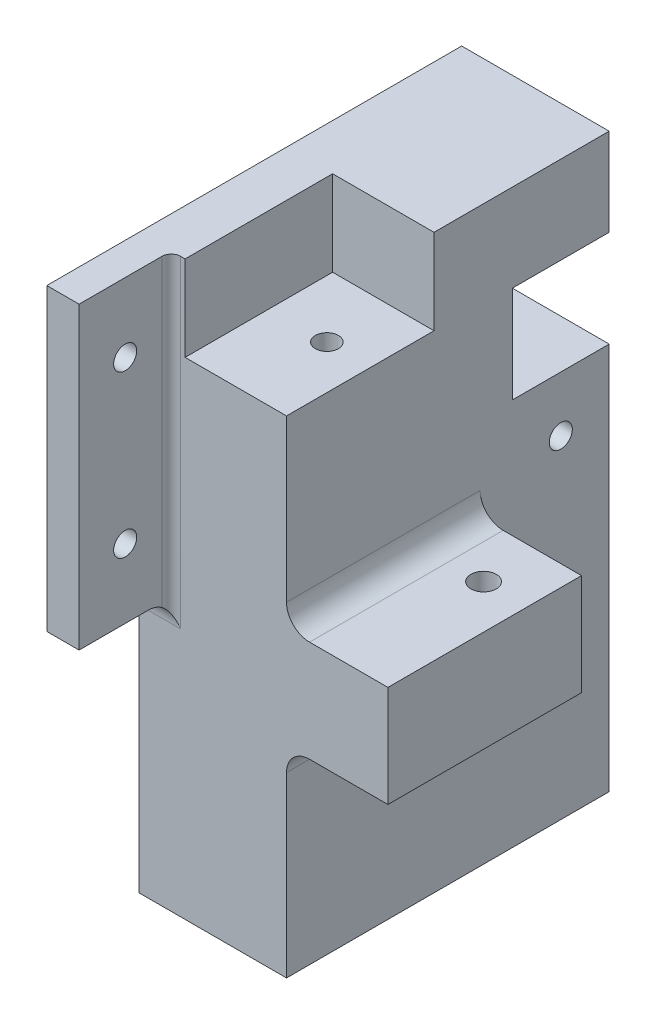
ISO-10303-21;
HEADER;
FILE_DESCRIPTION(('STEP AP214'),'2;1');
FILE_NAME('part.step','',(''),(''),'','','');
FILE_SCHEMA(('AUTOMOTIVE_DESIGN { 1 0 10303 214 1 1 1 1 }'));
ENDSEC;
DATA;
#1=APPLICATION_CONTEXT('core data for automotive mechanical design processes');
#2=APPLICATION_PROTOCOL_DEFINITION('international standard','automotive_design',2000,#1);
#3=PRODUCT_CONTEXT('',#1,'mechanical');
#4=PRODUCT('Part','Part','',(#3));
#5=PRODUCT_RELATED_PRODUCT_CATEGORY('part','',(#4));
#6=PRODUCT_DEFINITION_FORMATION('','',#4);
#7=PRODUCT_DEFINITION_CONTEXT('part definition',#1,'design');
#8=PRODUCT_DEFINITION('design','',#6,#7);
#9=PRODUCT_DEFINITION_SHAPE('','',#8);
#10=(LENGTH_UNIT() NAMED_UNIT(*) SI_UNIT(.MILLI.,.METRE.));
#11=(NAMED_UNIT(*) PLANE_ANGLE_UNIT() SI_UNIT($,.RADIAN.));
#12=(NAMED_UNIT(*) SI_UNIT($,.STERADIAN.) SOLID_ANGLE_UNIT());
#13=UNCERTAINTY_MEASURE_WITH_UNIT(LENGTH_MEASURE(1.E-05),#10,'distance_accuracy_value','');
#14=(GEOMETRIC_REPRESENTATION_CONTEXT(3) GLOBAL_UNCERTAINTY_ASSIGNED_CONTEXT((#13)) GLOBAL_UNIT_ASSIGNED_CONTEXT((#10,
#11,#12)) REPRESENTATION_CONTEXT('',''));
#15=CARTESIAN_POINT('',(0.,0.,0.));
#16=DIRECTION('',(0.,0.,1.));
#17=DIRECTION('',(1.,0.,0.));
#18=AXIS2_PLACEMENT_3D('',#15,#16,#17);
#19=CARTESIAN_POINT('',(-16.,40.,35.));
#20=DIRECTION('',(0.,0.,-1.));
#21=DIRECTION('',(-1.,0.,0.));
#22=AXIS2_PLACEMENT_3D('',#19,#20,#21);
#23=PLANE('',#22);
#24=DIRECTION('',(0.,1.,0.));
#25=VECTOR('',#24,1.);
#26=CARTESIAN_POINT('',(-6.99999999999999,-25.,35.));
#27=LINE('',#26,#25);
#28=CARTESIAN_POINT('',(-7.,40.,35.));
#29=VERTEX_POINT('',#28);
#30=CARTESIAN_POINT('',(-6.99999999999999,-30.,35.));
#31=VERTEX_POINT('',#30);
#32=EDGE_CURVE('E58',#29,#31,#27,.F.);
#33=ORIENTED_EDGE('',*,*,#32,.T.);
#34=DIRECTION('',(1.,0.,0.));
#35=VECTOR('',#34,1.);
#36=CARTESIAN_POINT('',(-16.,-30.,35.));
#37=LINE('',#36,#35);
#38=CARTESIAN_POINT('',(-16.,-30.,35.));
#39=VERTEX_POINT('',#38);
#40=EDGE_CURVE('E345',#31,#39,#37,.F.);
#41=ORIENTED_EDGE('',*,*,#40,.T.);
#42=DIRECTION('',(0.,-1.,0.));
#43=VECTOR('',#42,1.);
#44=CARTESIAN_POINT('',(-16.,40.,35.));
#45=LINE('',#44,#43);
#46=CARTESIAN_POINT('',(-16.,-84.1,35.));
#47=VERTEX_POINT('',#46);
#48=EDGE_CURVE('E319',#39,#47,#45,.T.);
#49=ORIENTED_EDGE('',*,*,#48,.T.);
#50=DIRECTION('',(1.,0.,0.));
#51=VECTOR('',#50,1.);
#52=CARTESIAN_POINT('',(-16.,-84.1,35.));
#53=LINE('',#52,#51);
#54=CARTESIAN_POINT('',(16.,-84.1,35.));
#55=VERTEX_POINT('',#54);
#56=EDGE_CURVE('E304',#47,#55,#53,.T.);
#57=ORIENTED_EDGE('',*,*,#56,.T.);
#58=DIRECTION('',(0.,-1.,0.));
#59=VECTOR('',#58,1.);
#60=CARTESIAN_POINT('',(16.,40.,35.));
#61=LINE('',#60,#59);
#62=CARTESIAN_POINT('',(16.,-45.5000000000002,35.));
#63=VERTEX_POINT('',#62);
#64=EDGE_CURVE('E315',#63,#55,#61,.T.);
#65=ORIENTED_EDGE('',*,*,#64,.F.);
#66=CARTESIAN_POINT('',(21.,-45.5000000000002,35.));
#67=DIRECTION('',(0.,0.,-1.));
#68=DIRECTION('',(-1.,0.,0.));
#69=AXIS2_PLACEMENT_3D('',#66,#67,#68);
#70=CIRCLE('',#69,5.);
#71=CARTESIAN_POINT('',(21.,-40.5000000000002,35.));
#72=VERTEX_POINT('',#71);
#73=EDGE_CURVE('E350',#63,#72,#70,.T.);
#74=ORIENTED_EDGE('',*,*,#73,.T.);
#75=DIRECTION('',(-1.,0.,0.));
#76=VECTOR('',#75,1.);
#77=CARTESIAN_POINT('',(38.,-40.5000000000002,35.));
#78=LINE('',#77,#76);
#79=CARTESIAN_POINT('',(38.,-40.5000000000002,35.));
#80=VERTEX_POINT('',#79);
#81=EDGE_CURVE('E242',#80,#72,#78,.T.);
#82=ORIENTED_EDGE('',*,*,#81,.F.);
#83=DIRECTION('',(0.,-1.,0.));
#84=VECTOR('',#83,1.);
#85=CARTESIAN_POINT('',(38.,-40.5000000000002,35.));
#86=LINE('',#85,#84);
#87=CARTESIAN_POINT('',(38.,-18.5000000000002,35.));
#88=VERTEX_POINT('',#87);
#89=EDGE_CURVE('E223',#88,#80,#86,.T.);
#90=ORIENTED_EDGE('',*,*,#89,.F.);
#91=DIRECTION('',(-1.,0.,0.));
#92=VECTOR('',#91,1.);
#93=CARTESIAN_POINT('',(38.,-18.5000000000002,35.));
#94=LINE('',#93,#92);
#95=CARTESIAN_POINT('',(21.,-18.5000000000002,35.));
#96=VERTEX_POINT('',#95);
#97=EDGE_CURVE('E232',#88,#96,#94,.T.);
#98=ORIENTED_EDGE('',*,*,#97,.T.);
#99=CARTESIAN_POINT('',(21.,-13.5000000000002,35.));
#100=DIRECTION('',(0.,0.,-1.));
#101=DIRECTION('',(-1.,0.,0.));
#102=AXIS2_PLACEMENT_3D('',#99,#100,#101);
#103=CIRCLE('',#102,5.);
#104=CARTESIAN_POINT('',(16.,-13.5000000000002,35.));
#105=VERTEX_POINT('',#104);
#106=EDGE_CURVE('E352',#96,#105,#103,.T.);
#107=ORIENTED_EDGE('',*,*,#106,.T.);
#108=CARTESIAN_POINT('',(16.,21.4999999999998,35.));
#109=VERTEX_POINT('',#108);
#110=EDGE_CURVE('E316',#109,#105,#61,.T.);
#111=ORIENTED_EDGE('',*,*,#110,.F.);
#112=DIRECTION('',(1.,0.,0.));
#113=VECTOR('',#112,1.);
#114=CARTESIAN_POINT('',(-6.00000000000013,21.4999999999997,35.));
#115=LINE('',#114,#113);
#116=CARTESIAN_POINT('',(-5.99999999999999,21.4999999999997,35.));
#117=VERTEX_POINT('',#116);
#118=EDGE_CURVE('E254',#117,#109,#115,.T.);
#119=ORIENTED_EDGE('',*,*,#118,.F.);
#120=DIRECTION('',(0.,1.,0.));
#121=VECTOR('',#120,1.);
#122=CARTESIAN_POINT('',(-5.99999999999999,-17.3329756778954,35.));
#123=LINE('',#122,#121);
#124=CARTESIAN_POINT('',(-5.99999999999999,40.,35.));
#125=VERTEX_POINT('',#124);
#126=EDGE_CURVE('E257',#117,#125,#123,.T.);
#127=ORIENTED_EDGE('',*,*,#126,.T.);
#128=DIRECTION('',(1.,0.,0.));
#129=VECTOR('',#128,1.);
#130=CARTESIAN_POINT('',(-16.,40.,35.));
#131=LINE('',#130,#129);
#132=EDGE_CURVE('E313',#29,#125,#131,.T.);
#133=ORIENTED_EDGE('',*,*,#132,.F.);
#134=EDGE_LOOP('',(#33,#41,#49,#57,#65,#74,#82,#90,#98,#107,#111,#119,#127,#133));
#135=FACE_BOUND('',#134,.T.);
#136=ADVANCED_FACE('F34',(#135),#23,.F.);
#137=CARTESIAN_POINT('',(16.,40.,-35.));
#138=DIRECTION('',(-1.,0.,0.));
#139=DIRECTION('',(0.,0.,1.));
#140=AXIS2_PLACEMENT_3D('',#137,#138,#139);
#141=PLANE('',#140);
#142=CARTESIAN_POINT('',(16.,-12.,-24.5));
#143=DIRECTION('',(-1.,0.,0.));
#144=DIRECTION('',(0.,0.,1.));
#145=AXIS2_PLACEMENT_3D('',#142,#143,#144);
#146=CIRCLE('',#145,2.5);
#147=CARTESIAN_POINT('',(16.,-12.,-22.));
#148=VERTEX_POINT('',#147);
#149=EDGE_CURVE('E205',#148,#148,#146,.T.);
#150=ORIENTED_EDGE('',*,*,#149,.T.);
#151=EDGE_LOOP('',(#150));
#152=FACE_BOUND('',#151,.T.);
#153=DIRECTION('',(0.,1.,0.));
#154=VECTOR('',#153,1.);
#155=CARTESIAN_POINT('',(16.,-18.5000000000002,-7.));
#156=LINE('',#155,#154);
#157=CARTESIAN_POINT('',(16.,-45.5000000000002,-7.));
#158=VERTEX_POINT('',#157);
#159=CARTESIAN_POINT('',(16.,-13.5000000000002,-7.));
#160=VERTEX_POINT('',#159);
#161=EDGE_CURVE('E222',#158,#160,#156,.T.);
#162=ORIENTED_EDGE('',*,*,#161,.F.);
#163=DIRECTION('',(0.,0.,-1.));
#164=VECTOR('',#163,1.);
#165=CARTESIAN_POINT('',(16.,-45.5000000000002,35.));
#166=LINE('',#165,#164);
#167=EDGE_CURVE('E338',#158,#63,#166,.F.);
#168=ORIENTED_EDGE('',*,*,#167,.T.);
#169=ORIENTED_EDGE('',*,*,#64,.T.);
#170=DIRECTION('',(0.,0.,-1.));
#171=VECTOR('',#170,1.);
#172=CARTESIAN_POINT('',(16.,-84.1,-35.));
#173=LINE('',#172,#171);
#174=CARTESIAN_POINT('',(16.,-84.1,-35.));
#175=VERTEX_POINT('',#174);
#176=EDGE_CURVE('E289',#55,#175,#173,.T.);
#177=ORIENTED_EDGE('',*,*,#176,.T.);
#178=DIRECTION('',(0.,-1.,0.));
#179=VECTOR('',#178,1.);
#180=CARTESIAN_POINT('',(16.,40.,-35.));
#181=LINE('',#180,#179);
#182=CARTESIAN_POINT('',(16.,0.,-35.));
#183=VERTEX_POINT('',#182);
#184=EDGE_CURVE('E324',#183,#175,#181,.T.);
#185=ORIENTED_EDGE('',*,*,#184,.F.);
#186=DIRECTION('',(0.,0.,-1.));
#187=VECTOR('',#186,1.);
#188=CARTESIAN_POINT('',(16.,0.,-35.));
#189=LINE('',#188,#187);
#190=CARTESIAN_POINT('',(16.,0.,-14.));
#191=VERTEX_POINT('',#190);
#192=EDGE_CURVE('E272',#191,#183,#189,.T.);
#193=ORIENTED_EDGE('',*,*,#192,.F.);
#194=DIRECTION('',(0.,-1.,0.));
#195=VECTOR('',#194,1.);
#196=CARTESIAN_POINT('',(16.,21.,-14.));
#197=LINE('',#196,#195);
#198=CARTESIAN_POINT('',(16.,21.,-14.));
#199=VERTEX_POINT('',#198);
#200=EDGE_CURVE('E256',#199,#191,#197,.T.);
#201=ORIENTED_EDGE('',*,*,#200,.F.);
#202=DIRECTION('',(0.,0.,1.));
#203=VECTOR('',#202,1.);
#204=CARTESIAN_POINT('',(16.,21.,-35.));
#205=LINE('',#204,#203);
#206=CARTESIAN_POINT('',(16.,21.,-35.));
#207=VERTEX_POINT('',#206);
#208=EDGE_CURVE('E274',#207,#199,#205,.T.);
#209=ORIENTED_EDGE('',*,*,#208,.F.);
#210=CARTESIAN_POINT('',(16.,40.,-35.));
#211=VERTEX_POINT('',#210);
#212=EDGE_CURVE('E325',#211,#207,#181,.T.);
#213=ORIENTED_EDGE('',*,*,#212,.F.);
#214=DIRECTION('',(0.,0.,-1.));
#215=VECTOR('',#214,1.);
#216=CARTESIAN_POINT('',(16.,40.,-35.));
#217=LINE('',#216,#215);
#218=CARTESIAN_POINT('',(16.,40.,3.));
#219=VERTEX_POINT('',#218);
#220=EDGE_CURVE('E307',#219,#211,#217,.T.);
#221=ORIENTED_EDGE('',*,*,#220,.F.);
#222=DIRECTION('',(0.,1.,0.));
#223=VECTOR('',#222,1.);
#224=CARTESIAN_POINT('',(16.,-17.3329756778954,3.));
#225=LINE('',#224,#223);
#226=CARTESIAN_POINT('',(16.,21.4999999999998,3.));
#227=VERTEX_POINT('',#226);
#228=EDGE_CURVE('E253',#227,#219,#225,.T.);
#229=ORIENTED_EDGE('',*,*,#228,.F.);
#230=DIRECTION('',(0.,0.,-1.));
#231=VECTOR('',#230,1.);
#232=CARTESIAN_POINT('',(16.,21.4999999999998,35.));
#233=LINE('',#232,#231);
#234=EDGE_CURVE('E249',#109,#227,#233,.T.);
#235=ORIENTED_EDGE('',*,*,#234,.F.);
#236=ORIENTED_EDGE('',*,*,#110,.T.);
#237=DIRECTION('',(0.,0.,1.));
#238=VECTOR('',#237,1.);
#239=CARTESIAN_POINT('',(16.,-13.5000000000002,-7.));
#240=LINE('',#239,#238);
#241=EDGE_CURVE('E335',#105,#160,#240,.F.);
#242=ORIENTED_EDGE('',*,*,#241,.T.);
#243=EDGE_LOOP('',(#162,#168,#169,#177,#185,#193,#201,#209,#213,#221,#229,#235,#236,#242));
#244=FACE_BOUND('',#243,.T.);
#245=ADVANCED_FACE('F369',(#152,#244),#141,.F.);
#246=CARTESIAN_POINT('',(-16.,40.,-35.));
#247=DIRECTION('',(0.,0.,1.));
#248=DIRECTION('',(1.,0.,0.));
#249=AXIS2_PLACEMENT_3D('',#246,#247,#248);
#250=PLANE('',#249);
#251=ORIENTED_EDGE('',*,*,#212,.T.);
#252=DIRECTION('',(1.,0.,0.));
#253=VECTOR('',#252,1.);
#254=CARTESIAN_POINT('',(-16.,21.,-35.));
#255=LINE('',#254,#253);
#256=CARTESIAN_POINT('',(-16.,21.,-35.));
#257=VERTEX_POINT('',#256);
#258=EDGE_CURVE('E290',#257,#207,#255,.T.);
#259=ORIENTED_EDGE('',*,*,#258,.F.);
#260=DIRECTION('',(0.,-1.,0.));
#261=VECTOR('',#260,1.);
#262=CARTESIAN_POINT('',(-16.,40.,-35.));
#263=LINE('',#262,#261);
#264=CARTESIAN_POINT('',(-16.,40.,-35.));
#265=VERTEX_POINT('',#264);
#266=EDGE_CURVE('E322',#265,#257,#263,.T.);
#267=ORIENTED_EDGE('',*,*,#266,.F.);
#268=DIRECTION('',(-1.,0.,0.));
#269=VECTOR('',#268,1.);
#270=CARTESIAN_POINT('',(-16.,40.,-35.));
#271=LINE('',#270,#269);
#272=EDGE_CURVE('E309',#211,#265,#271,.T.);
#273=ORIENTED_EDGE('',*,*,#272,.F.);
#274=EDGE_LOOP('',(#251,#259,#267,#273));
#275=FACE_BOUND('',#274,.T.);
#276=ADVANCED_FACE('F387',(#275),#250,.F.);
#277=CARTESIAN_POINT('',(-16.,0.,-35.));
#278=VERTEX_POINT('',#277);
#279=CARTESIAN_POINT('',(-16.,-84.1,-35.));
#280=VERTEX_POINT('',#279);
#281=EDGE_CURVE('E321',#278,#280,#263,.T.);
#282=ORIENTED_EDGE('',*,*,#281,.F.);
#283=DIRECTION('',(1.,0.,0.));
#284=VECTOR('',#283,1.);
#285=CARTESIAN_POINT('',(-16.,0.,-35.));
#286=LINE('',#285,#284);
#287=EDGE_CURVE('E292',#278,#183,#286,.T.);
#288=ORIENTED_EDGE('',*,*,#287,.T.);
#289=ORIENTED_EDGE('',*,*,#184,.T.);
#290=DIRECTION('',(-1.,0.,0.));
#291=VECTOR('',#290,1.);
#292=CARTESIAN_POINT('',(-16.,-84.1,-35.));
#293=LINE('',#292,#291);
#294=EDGE_CURVE('E298',#175,#280,#293,.T.);
#295=ORIENTED_EDGE('',*,*,#294,.T.);
#296=EDGE_LOOP('',(#282,#288,#289,#295));
#297=FACE_BOUND('',#296,.T.);
#298=ADVANCED_FACE('F394',(#297),#250,.F.);
#299=CARTESIAN_POINT('',(-16.,40.,-35.));
#300=DIRECTION('',(1.,0.,0.));
#301=DIRECTION('',(0.,0.,-1.));
#302=AXIS2_PLACEMENT_3D('',#299,#300,#301);
#303=PLANE('',#302);
#304=CARTESIAN_POINT('',(-16.,25.,45.));
#305=DIRECTION('',(1.,0.,0.));
#306=DIRECTION('',(0.,1.,0.));
#307=AXIS2_PLACEMENT_3D('',#304,#305,#306);
#308=CIRCLE('',#307,2.5);
#309=CARTESIAN_POINT('',(-16.,27.5,45.));
#310=VERTEX_POINT('',#309);
#311=EDGE_CURVE('E718',#310,#310,#308,.T.);
#312=ORIENTED_EDGE('',*,*,#311,.T.);
#313=EDGE_LOOP('',(#312));
#314=FACE_BOUND('',#313,.T.);
#315=CARTESIAN_POINT('',(-16.,-10.,45.));
#316=DIRECTION('',(1.,0.,0.));
#317=DIRECTION('',(0.,1.,0.));
#318=AXIS2_PLACEMENT_3D('',#315,#316,#317);
#319=CIRCLE('',#318,2.5);
#320=CARTESIAN_POINT('',(-16.,-7.5,45.));
#321=VERTEX_POINT('',#320);
#322=EDGE_CURVE('E724',#321,#321,#319,.T.);
#323=ORIENTED_EDGE('',*,*,#322,.T.);
#324=EDGE_LOOP('',(#323));
#325=FACE_BOUND('',#324,.T.);
#326=CARTESIAN_POINT('',(-16.,-12.,-24.5));
#327=DIRECTION('',(-1.,0.,0.));
#328=DIRECTION('',(0.,0.,1.));
#329=AXIS2_PLACEMENT_3D('',#326,#327,#328);
#330=CIRCLE('',#329,2.5);
#331=CARTESIAN_POINT('',(-16.,-12.,-22.));
#332=VERTEX_POINT('',#331);
#333=EDGE_CURVE('E714',#332,#332,#330,.T.);
#334=ORIENTED_EDGE('',*,*,#333,.F.);
#335=EDGE_LOOP('',(#334));
#336=FACE_BOUND('',#335,.T.);
#337=ORIENTED_EDGE('',*,*,#266,.T.);
#338=DIRECTION('',(0.,0.,1.));
#339=VECTOR('',#338,1.);
#340=CARTESIAN_POINT('',(-16.,21.,-35.));
#341=LINE('',#340,#339);
#342=CARTESIAN_POINT('',(-16.,21.,-14.));
#343=VERTEX_POINT('',#342);
#344=EDGE_CURVE('E283',#257,#343,#341,.T.);
#345=ORIENTED_EDGE('',*,*,#344,.T.);
#346=DIRECTION('',(0.,-1.,0.));
#347=VECTOR('',#346,1.);
#348=CARTESIAN_POINT('',(-16.,21.,-14.));
#349=LINE('',#348,#347);
#350=CARTESIAN_POINT('',(-16.,0.,-14.));
#351=VERTEX_POINT('',#350);
#352=EDGE_CURVE('E277',#343,#351,#349,.T.);
#353=ORIENTED_EDGE('',*,*,#352,.T.);
#354=DIRECTION('',(0.,0.,-1.));
#355=VECTOR('',#354,1.);
#356=CARTESIAN_POINT('',(-16.,0.,-35.));
#357=LINE('',#356,#355);
#358=EDGE_CURVE('E280',#351,#278,#357,.T.);
#359=ORIENTED_EDGE('',*,*,#358,.T.);
#360=ORIENTED_EDGE('',*,*,#281,.T.);
#361=DIRECTION('',(0.,0.,1.));
#362=VECTOR('',#361,1.);
#363=CARTESIAN_POINT('',(-16.,-84.1,-35.));
#364=LINE('',#363,#362);
#365=EDGE_CURVE('E301',#280,#47,#364,.T.);
#366=ORIENTED_EDGE('',*,*,#365,.T.);
#367=ORIENTED_EDGE('',*,*,#48,.F.);
#368=CARTESIAN_POINT('',(-16.,-30.,40.));
#369=DIRECTION('',(1.,0.,0.));
#370=DIRECTION('',(0.,0.,-1.));
#371=AXIS2_PLACEMENT_3D('',#368,#369,#370);
#372=CIRCLE('',#371,5.);
#373=CARTESIAN_POINT('',(-16.,-25.,40.));
#374=VERTEX_POINT('',#373);
#375=EDGE_CURVE('E11',#39,#374,#372,.T.);
#376=ORIENTED_EDGE('',*,*,#375,.T.);
#377=DIRECTION('',(0.,0.,-1.));
#378=VECTOR('',#377,1.);
#379=CARTESIAN_POINT('',(-16.,-25.,55.));
#380=LINE('',#379,#378);
#381=CARTESIAN_POINT('',(-16.,-25.,55.));
#382=VERTEX_POINT('',#381);
#383=EDGE_CURVE('E189',#382,#374,#380,.T.);
#384=ORIENTED_EDGE('',*,*,#383,.F.);
#385=DIRECTION('',(0.,-1.,0.));
#386=VECTOR('',#385,1.);
#387=CARTESIAN_POINT('',(-16.,-25.,55.));
#388=LINE('',#387,#386);
#389=CARTESIAN_POINT('',(-16.,40.,55.));
#390=VERTEX_POINT('',#389);
#391=EDGE_CURVE('E196',#390,#382,#388,.T.);
#392=ORIENTED_EDGE('',*,*,#391,.F.);
#393=DIRECTION('',(0.,0.,1.));
#394=VECTOR('',#393,1.);
#395=CARTESIAN_POINT('',(-16.,40.,-35.));
#396=LINE('',#395,#394);
#397=EDGE_CURVE('E311',#265,#390,#396,.T.);
#398=ORIENTED_EDGE('',*,*,#397,.F.);
#399=EDGE_LOOP('',(#337,#345,#353,#359,#360,#366,#367,#376,#384,#392,#398));
#400=FACE_BOUND('',#399,.T.);
#401=ADVANCED_FACE('F208',(#314,#325,#336,#400),#303,.F.);
#402=CARTESIAN_POINT('',(0.,40.,0.));
#403=DIRECTION('',(0.,1.,0.));
#404=DIRECTION('',(0.,0.,1.));
#405=AXIS2_PLACEMENT_3D('',#402,#403,#404);
#406=PLANE('',#405);
#407=DIRECTION('',(-1.,0.,0.));
#408=VECTOR('',#407,1.);
#409=CARTESIAN_POINT('',(-5.99999999999999,40.,3.));
#410=LINE('',#409,#408);
#411=CARTESIAN_POINT('',(-5.99999999999999,40.,3.));
#412=VERTEX_POINT('',#411);
#413=EDGE_CURVE('E245',#219,#412,#410,.T.);
#414=ORIENTED_EDGE('',*,*,#413,.F.);
#415=ORIENTED_EDGE('',*,*,#220,.T.);
#416=ORIENTED_EDGE('',*,*,#272,.T.);
#417=ORIENTED_EDGE('',*,*,#397,.T.);
#418=DIRECTION('',(-1.,0.,0.));
#419=VECTOR('',#418,1.);
#420=CARTESIAN_POINT('',(-16.,40.,55.));
#421=LINE('',#420,#419);
#422=CARTESIAN_POINT('',(-9.,40.,55.));
#423=VERTEX_POINT('',#422);
#424=EDGE_CURVE('E202',#423,#390,#421,.T.);
#425=ORIENTED_EDGE('',*,*,#424,.F.);
#426=DIRECTION('',(0.,0.,-1.));
#427=VECTOR('',#426,1.);
#428=CARTESIAN_POINT('',(-9.,40.,55.));
#429=LINE('',#428,#427);
#430=CARTESIAN_POINT('',(-9.,40.,37.));
#431=VERTEX_POINT('',#430);
#432=EDGE_CURVE('E216',#423,#431,#429,.T.);
#433=ORIENTED_EDGE('',*,*,#432,.T.);
#434=CARTESIAN_POINT('',(-7.,40.,37.));
#435=DIRECTION('',(0.,1.,0.));
#436=DIRECTION('',(0.,0.,1.));
#437=AXIS2_PLACEMENT_3D('',#434,#435,#436);
#438=CIRCLE('',#437,2.);
#439=EDGE_CURVE('E330',#431,#29,#438,.F.);
#440=ORIENTED_EDGE('',*,*,#439,.T.);
#441=ORIENTED_EDGE('',*,*,#132,.T.);
#442=DIRECTION('',(0.,0.,1.));
#443=VECTOR('',#442,1.);
#444=CARTESIAN_POINT('',(-5.99999999999999,40.,35.));
#445=LINE('',#444,#443);
#446=EDGE_CURVE('E246',#412,#125,#445,.T.);
#447=ORIENTED_EDGE('',*,*,#446,.F.);
#448=EDGE_LOOP('',(#414,#415,#416,#417,#425,#433,#440,#441,#447));
#449=FACE_BOUND('',#448,.T.);
#450=ADVANCED_FACE('F391',(#449),#406,.T.);
#451=CARTESIAN_POINT('',(0.,-84.1,0.));
#452=DIRECTION('',(0.,1.,0.));
#453=DIRECTION('',(0.,0.,1.));
#454=AXIS2_PLACEMENT_3D('',#451,#452,#453);
#455=PLANE('',#454);
#456=ORIENTED_EDGE('',*,*,#176,.F.);
#457=ORIENTED_EDGE('',*,*,#56,.F.);
#458=ORIENTED_EDGE('',*,*,#365,.F.);
#459=ORIENTED_EDGE('',*,*,#294,.F.);
#460=EDGE_LOOP('',(#456,#457,#458,#459));
#461=FACE_BOUND('',#460,.T.);
#462=ADVANCED_FACE('F410',(#461),#455,.F.);
#463=CARTESIAN_POINT('',(-16.,21.,-14.));
#464=DIRECTION('',(0.,0.,1.));
#465=DIRECTION('',(0.,-1.,0.));
#466=AXIS2_PLACEMENT_3D('',#463,#464,#465);
#467=PLANE('',#466);
#468=DIRECTION('',(1.,0.,0.));
#469=VECTOR('',#468,1.);
#470=CARTESIAN_POINT('',(-16.,0.,-14.));
#471=LINE('',#470,#469);
#472=EDGE_CURVE('E286',#351,#191,#471,.T.);
#473=ORIENTED_EDGE('',*,*,#472,.F.);
#474=ORIENTED_EDGE('',*,*,#352,.F.);
#475=DIRECTION('',(1.,0.,0.));
#476=VECTOR('',#475,1.);
#477=CARTESIAN_POINT('',(-16.,21.,-14.));
#478=LINE('',#477,#476);
#479=EDGE_CURVE('E287',#343,#199,#478,.T.);
#480=ORIENTED_EDGE('',*,*,#479,.T.);
#481=ORIENTED_EDGE('',*,*,#200,.T.);
#482=EDGE_LOOP('',(#473,#474,#480,#481));
#483=FACE_BOUND('',#482,.T.);
#484=ADVANCED_FACE('F435',(#483),#467,.F.);
#485=CARTESIAN_POINT('',(-16.,21.,-35.));
#486=DIRECTION('',(0.,1.,0.));
#487=DIRECTION('',(0.,0.,1.));
#488=AXIS2_PLACEMENT_3D('',#485,#486,#487);
#489=PLANE('',#488);
#490=ORIENTED_EDGE('',*,*,#479,.F.);
#491=ORIENTED_EDGE('',*,*,#344,.F.);
#492=ORIENTED_EDGE('',*,*,#258,.T.);
#493=ORIENTED_EDGE('',*,*,#208,.T.);
#494=EDGE_LOOP('',(#490,#491,#492,#493));
#495=FACE_BOUND('',#494,.T.);
#496=ADVANCED_FACE('F429',(#495),#489,.F.);
#497=CARTESIAN_POINT('',(-16.,0.,-35.));
#498=DIRECTION('',(0.,-1.,0.));
#499=DIRECTION('',(0.,0.,-1.));
#500=AXIS2_PLACEMENT_3D('',#497,#498,#499);
#501=PLANE('',#500);
#502=ORIENTED_EDGE('',*,*,#287,.F.);
#503=ORIENTED_EDGE('',*,*,#358,.F.);
#504=ORIENTED_EDGE('',*,*,#472,.T.);
#505=ORIENTED_EDGE('',*,*,#192,.T.);
#506=EDGE_LOOP('',(#502,#503,#504,#505));
#507=FACE_BOUND('',#506,.T.);
#508=ADVANCED_FACE('F438',(#507),#501,.F.);
#509=CARTESIAN_POINT('',(32.276000000002,21.4999999999999,-10.2240000000004));
#510=DIRECTION('',(0.,-1.,0.));
#511=DIRECTION('',(1.,0.,0.));
#512=AXIS2_PLACEMENT_3D('',#509,#510,#511);
#513=PLANE('',#512);
#514=CARTESIAN_POINT('',(6.50000000000001,21.4999999999998,16.75));
#515=DIRECTION('',(0.,1.,0.));
#516=DIRECTION('',(-1.,0.,0.));
#517=AXIS2_PLACEMENT_3D('',#514,#515,#516);
#518=CIRCLE('',#517,2.5);
#519=CARTESIAN_POINT('',(4.00000000000001,21.4999999999998,16.75));
#520=VERTEX_POINT('',#519);
#521=EDGE_CURVE('E733',#520,#520,#518,.T.);
#522=ORIENTED_EDGE('',*,*,#521,.F.);
#523=EDGE_LOOP('',(#522));
#524=FACE_BOUND('',#523,.T.);
#525=ORIENTED_EDGE('',*,*,#118,.T.);
#526=ORIENTED_EDGE('',*,*,#234,.T.);
#527=DIRECTION('',(-1.,0.,0.));
#528=VECTOR('',#527,1.);
#529=CARTESIAN_POINT('',(-6.00000000000013,21.4999999999997,3.));
#530=LINE('',#529,#528);
#531=CARTESIAN_POINT('',(-5.99999999999999,21.4999999999997,3.));
#532=VERTEX_POINT('',#531);
#533=EDGE_CURVE('E262',#227,#532,#530,.T.);
#534=ORIENTED_EDGE('',*,*,#533,.T.);
#535=DIRECTION('',(0.,0.,1.));
#536=VECTOR('',#535,1.);
#537=CARTESIAN_POINT('',(-5.99999999999999,21.4999999999997,35.));
#538=LINE('',#537,#536);
#539=EDGE_CURVE('E258',#532,#117,#538,.T.);
#540=ORIENTED_EDGE('',*,*,#539,.T.);
#541=EDGE_LOOP('',(#525,#526,#534,#540));
#542=FACE_BOUND('',#541,.T.);
#543=ADVANCED_FACE('F440',(#524,#542),#513,.F.);
#544=CARTESIAN_POINT('',(-5.99999999999999,-17.3329756778954,3.));
#545=DIRECTION('',(0.,0.,-1.));
#546=DIRECTION('',(-1.,0.,0.));
#547=AXIS2_PLACEMENT_3D('',#544,#545,#546);
#548=PLANE('',#547);
#549=ORIENTED_EDGE('',*,*,#228,.T.);
#550=ORIENTED_EDGE('',*,*,#413,.T.);
#551=DIRECTION('',(0.,1.,0.));
#552=VECTOR('',#551,1.);
#553=CARTESIAN_POINT('',(-5.99999999999999,-17.3329756778954,3.));
#554=LINE('',#553,#552);
#555=EDGE_CURVE('E261',#532,#412,#554,.T.);
#556=ORIENTED_EDGE('',*,*,#555,.F.);
#557=ORIENTED_EDGE('',*,*,#533,.F.);
#558=EDGE_LOOP('',(#549,#550,#556,#557));
#559=FACE_BOUND('',#558,.T.);
#560=ADVANCED_FACE('F446',(#559),#548,.F.);
#561=CARTESIAN_POINT('',(-5.99999999999999,-17.3329756778954,35.));
#562=DIRECTION('',(-1.,0.,0.));
#563=DIRECTION('',(0.,0.,1.));
#564=AXIS2_PLACEMENT_3D('',#561,#562,#563);
#565=PLANE('',#564);
#566=ORIENTED_EDGE('',*,*,#555,.T.);
#567=ORIENTED_EDGE('',*,*,#446,.T.);
#568=ORIENTED_EDGE('',*,*,#126,.F.);
#569=ORIENTED_EDGE('',*,*,#539,.F.);
#570=EDGE_LOOP('',(#566,#567,#568,#569));
#571=FACE_BOUND('',#570,.T.);
#572=ADVANCED_FACE('F479',(#571),#565,.F.);
#573=CARTESIAN_POINT('',(38.,-40.5000000000002,-7.));
#574=DIRECTION('',(0.,1.,0.));
#575=DIRECTION('',(0.,0.,1.));
#576=AXIS2_PLACEMENT_3D('',#573,#574,#575);
#577=PLANE('',#576);
#578=CARTESIAN_POINT('',(28.5,-40.5000000000002,4.75));
#579=DIRECTION('',(0.,1.,0.));
#580=DIRECTION('',(0.,0.,1.));
#581=AXIS2_PLACEMENT_3D('',#578,#579,#580);
#582=CIRCLE('',#581,2.75);
#583=CARTESIAN_POINT('',(28.5,-40.5000000000002,7.5));
#584=VERTEX_POINT('',#583);
#585=EDGE_CURVE('E214',#584,#584,#582,.T.);
#586=ORIENTED_EDGE('',*,*,#585,.T.);
#587=EDGE_LOOP('',(#586));
#588=FACE_BOUND('',#587,.T.);
#589=ORIENTED_EDGE('',*,*,#81,.T.);
#590=DIRECTION('',(0.,0.,-1.));
#591=VECTOR('',#590,1.);
#592=CARTESIAN_POINT('',(21.,-40.5000000000002,-7.));
#593=LINE('',#592,#591);
#594=CARTESIAN_POINT('',(21.,-40.5000000000002,-7.));
#595=VERTEX_POINT('',#594);
#596=EDGE_CURVE('E332',#72,#595,#593,.T.);
#597=ORIENTED_EDGE('',*,*,#596,.T.);
#598=DIRECTION('',(-1.,0.,0.));
#599=VECTOR('',#598,1.);
#600=CARTESIAN_POINT('',(38.,-40.5000000000002,-7.));
#601=LINE('',#600,#599);
#602=CARTESIAN_POINT('',(38.,-40.5000000000002,-7.));
#603=VERTEX_POINT('',#602);
#604=EDGE_CURVE('E239',#603,#595,#601,.T.);
#605=ORIENTED_EDGE('',*,*,#604,.F.);
#606=DIRECTION('',(0.,0.,-1.));
#607=VECTOR('',#606,1.);
#608=CARTESIAN_POINT('',(38.,-40.5000000000002,-7.));
#609=LINE('',#608,#607);
#610=EDGE_CURVE('E226',#80,#603,#609,.T.);
#611=ORIENTED_EDGE('',*,*,#610,.F.);
#612=EDGE_LOOP('',(#589,#597,#605,#611));
#613=FACE_BOUND('',#612,.T.);
#614=ADVANCED_FACE('F473',(#588,#613),#577,.F.);
#615=CARTESIAN_POINT('',(38.,-18.5000000000002,-7.));
#616=DIRECTION('',(0.,0.,1.));
#617=DIRECTION('',(0.,-1.,0.));
#618=AXIS2_PLACEMENT_3D('',#615,#616,#617);
#619=PLANE('',#618);
#620=ORIENTED_EDGE('',*,*,#161,.T.);
#621=CARTESIAN_POINT('',(21.,-13.5000000000002,-7.));
#622=DIRECTION('',(0.,0.,1.));
#623=DIRECTION('',(0.,-1.,0.));
#624=AXIS2_PLACEMENT_3D('',#621,#622,#623);
#625=CIRCLE('',#624,5.);
#626=CARTESIAN_POINT('',(21.,-18.5000000000002,-7.));
#627=VERTEX_POINT('',#626);
#628=EDGE_CURVE('E354',#160,#627,#625,.T.);
#629=ORIENTED_EDGE('',*,*,#628,.T.);
#630=DIRECTION('',(-1.,0.,0.));
#631=VECTOR('',#630,1.);
#632=CARTESIAN_POINT('',(38.,-18.5000000000002,-7.));
#633=LINE('',#632,#631);
#634=CARTESIAN_POINT('',(38.,-18.5000000000002,-7.));
#635=VERTEX_POINT('',#634);
#636=EDGE_CURVE('E236',#635,#627,#633,.T.);
#637=ORIENTED_EDGE('',*,*,#636,.F.);
#638=DIRECTION('',(0.,1.,0.));
#639=VECTOR('',#638,1.);
#640=CARTESIAN_POINT('',(38.,-18.5000000000002,-7.));
#641=LINE('',#640,#639);
#642=EDGE_CURVE('E228',#603,#635,#641,.T.);
#643=ORIENTED_EDGE('',*,*,#642,.F.);
#644=ORIENTED_EDGE('',*,*,#604,.T.);
#645=CARTESIAN_POINT('',(21.,-45.5000000000002,-7.));
#646=DIRECTION('',(0.,0.,1.));
#647=DIRECTION('',(0.,-1.,0.));
#648=AXIS2_PLACEMENT_3D('',#645,#646,#647);
#649=CIRCLE('',#648,5.);
#650=EDGE_CURVE('E347',#595,#158,#649,.T.);
#651=ORIENTED_EDGE('',*,*,#650,.T.);
#652=EDGE_LOOP('',(#620,#629,#637,#643,#644,#651));
#653=FACE_BOUND('',#652,.T.);
#654=ADVANCED_FACE('F478',(#653),#619,.F.);
#655=CARTESIAN_POINT('',(38.,-18.5000000000002,35.));
#656=DIRECTION('',(0.,-1.,0.));
#657=DIRECTION('',(0.,0.,-1.));
#658=AXIS2_PLACEMENT_3D('',#655,#656,#657);
#659=PLANE('',#658);
#660=CARTESIAN_POINT('',(28.5,-18.5000000000002,4.75));
#661=DIRECTION('',(0.,1.,0.));
#662=DIRECTION('',(0.,0.,1.));
#663=AXIS2_PLACEMENT_3D('',#660,#661,#662);
#664=CIRCLE('',#663,2.75);
#665=CARTESIAN_POINT('',(28.5,-18.5000000000002,7.5));
#666=VERTEX_POINT('',#665);
#667=EDGE_CURVE('E211',#666,#666,#664,.T.);
#668=ORIENTED_EDGE('',*,*,#667,.F.);
#669=EDGE_LOOP('',(#668));
#670=FACE_BOUND('',#669,.T.);
#671=ORIENTED_EDGE('',*,*,#636,.T.);
#672=DIRECTION('',(0.,0.,1.));
#673=VECTOR('',#672,1.);
#674=CARTESIAN_POINT('',(21.,-18.5000000000002,35.));
#675=LINE('',#674,#673);
#676=EDGE_CURVE('E340',#627,#96,#675,.T.);
#677=ORIENTED_EDGE('',*,*,#676,.T.);
#678=ORIENTED_EDGE('',*,*,#97,.F.);
#679=DIRECTION('',(0.,0.,1.));
#680=VECTOR('',#679,1.);
#681=CARTESIAN_POINT('',(38.,-18.5000000000002,35.));
#682=LINE('',#681,#680);
#683=EDGE_CURVE('E230',#635,#88,#682,.T.);
#684=ORIENTED_EDGE('',*,*,#683,.F.);
#685=EDGE_LOOP('',(#671,#677,#678,#684));
#686=FACE_BOUND('',#685,.T.);
#687=ADVANCED_FACE('F490',(#670,#686),#659,.F.);
#688=CARTESIAN_POINT('',(38.,0.,0.));
#689=DIRECTION('',(-1.,0.,0.));
#690=DIRECTION('',(0.,0.,1.));
#691=AXIS2_PLACEMENT_3D('',#688,#689,#690);
#692=PLANE('',#691);
#693=ORIENTED_EDGE('',*,*,#89,.T.);
#694=ORIENTED_EDGE('',*,*,#610,.T.);
#695=ORIENTED_EDGE('',*,*,#642,.T.);
#696=ORIENTED_EDGE('',*,*,#683,.T.);
#697=EDGE_LOOP('',(#693,#694,#695,#696));
#698=FACE_BOUND('',#697,.T.);
#699=ADVANCED_FACE('F500',(#698),#692,.F.);
#700=CARTESIAN_POINT('',(28.5,-84.1,4.75));
#701=DIRECTION('',(0.,1.,0.));
#702=DIRECTION('',(0.,0.,1.));
#703=AXIS2_PLACEMENT_3D('',#700,#701,#702);
#704=CYLINDRICAL_SURFACE('',#703,2.75);
#705=ORIENTED_EDGE('',*,*,#667,.T.);
#706=EDGE_LOOP('',(#705));
#707=FACE_BOUND('',#706,.T.);
#708=ORIENTED_EDGE('',*,*,#585,.F.);
#709=EDGE_LOOP('',(#708));
#710=FACE_BOUND('',#709,.T.);
#711=ADVANCED_FACE('F512',(#707,#710),#704,.F.);
#712=CARTESIAN_POINT('',(-8.99999999999999,-25.,55.));
#713=DIRECTION('',(0.,1.,0.));
#714=DIRECTION('',(0.,0.,1.));
#715=AXIS2_PLACEMENT_3D('',#712,#713,#714);
#716=PLANE('',#715);
#717=ORIENTED_EDGE('',*,*,#383,.T.);
#718=DIRECTION('',(1.,0.,0.));
#719=VECTOR('',#718,1.);
#720=CARTESIAN_POINT('',(-6.99999999999999,-25.,40.));
#721=LINE('',#720,#719);
#722=CARTESIAN_POINT('',(-8.99999999999999,-25.,40.));
#723=VERTEX_POINT('',#722);
#724=EDGE_CURVE('E343',#374,#723,#721,.T.);
#725=ORIENTED_EDGE('',*,*,#724,.T.);
#726=DIRECTION('',(0.,0.,-1.));
#727=VECTOR('',#726,1.);
#728=CARTESIAN_POINT('',(-8.99999999999999,-25.,55.));
#729=LINE('',#728,#727);
#730=CARTESIAN_POINT('',(-8.99999999999999,-25.,55.));
#731=VERTEX_POINT('',#730);
#732=EDGE_CURVE('E192',#731,#723,#729,.T.);
#733=ORIENTED_EDGE('',*,*,#732,.F.);
#734=DIRECTION('',(1.,0.,0.));
#735=VECTOR('',#734,1.);
#736=CARTESIAN_POINT('',(-8.99999999999999,-25.,55.));
#737=LINE('',#736,#735);
#738=EDGE_CURVE('E184',#382,#731,#737,.T.);
#739=ORIENTED_EDGE('',*,*,#738,.F.);
#740=EDGE_LOOP('',(#717,#725,#733,#739));
#741=FACE_BOUND('',#740,.T.);
#742=ADVANCED_FACE('F186',(#741),#716,.F.);
#743=CARTESIAN_POINT('',(-9.,40.,55.));
#744=DIRECTION('',(-1.,0.,0.));
#745=DIRECTION('',(0.,-1.,0.));
#746=AXIS2_PLACEMENT_3D('',#743,#744,#745);
#747=PLANE('',#746);
#748=CARTESIAN_POINT('',(-9.,25.,45.));
#749=DIRECTION('',(1.,0.,0.));
#750=DIRECTION('',(0.,1.,0.));
#751=AXIS2_PLACEMENT_3D('',#748,#749,#750);
#752=CIRCLE('',#751,2.5);
#753=CARTESIAN_POINT('',(-9.,27.5,45.));
#754=VERTEX_POINT('',#753);
#755=EDGE_CURVE('E728',#754,#754,#752,.T.);
#756=ORIENTED_EDGE('',*,*,#755,.F.);
#757=EDGE_LOOP('',(#756));
#758=FACE_BOUND('',#757,.T.);
#759=CARTESIAN_POINT('',(-8.99999999999999,-10.,45.));
#760=DIRECTION('',(1.,0.,0.));
#761=DIRECTION('',(0.,1.,0.));
#762=AXIS2_PLACEMENT_3D('',#759,#760,#761);
#763=CIRCLE('',#762,2.5);
#764=CARTESIAN_POINT('',(-8.99999999999999,-7.5,45.));
#765=VERTEX_POINT('',#764);
#766=EDGE_CURVE('E721',#765,#765,#763,.T.);
#767=ORIENTED_EDGE('',*,*,#766,.F.);
#768=EDGE_LOOP('',(#767));
#769=FACE_BOUND('',#768,.T.);
#770=ORIENTED_EDGE('',*,*,#732,.T.);
#771=CARTESIAN_POINT('',(-8.99999999999999,-30.,40.));
#772=DIRECTION('',(-1.,0.,0.));
#773=DIRECTION('',(0.,-1.,0.));
#774=AXIS2_PLACEMENT_3D('',#771,#772,#773);
#775=CIRCLE('',#774,5.);
#776=CARTESIAN_POINT('',(-8.99999999999999,-25.9999999999993,37.));
#777=VERTEX_POINT('',#776);
#778=EDGE_CURVE('E356',#723,#777,#775,.T.);
#779=ORIENTED_EDGE('',*,*,#778,.T.);
#780=DIRECTION('',(0.,1.,0.));
#781=VECTOR('',#780,1.);
#782=CARTESIAN_POINT('',(-9.,40.,37.));
#783=LINE('',#782,#781);
#784=EDGE_CURVE('E50',#777,#431,#783,.T.);
#785=ORIENTED_EDGE('',*,*,#784,.T.);
#786=ORIENTED_EDGE('',*,*,#432,.F.);
#787=DIRECTION('',(0.,1.,0.));
#788=VECTOR('',#787,1.);
#789=CARTESIAN_POINT('',(-9.,40.,55.));
#790=LINE('',#789,#788);
#791=EDGE_CURVE('E195',#731,#423,#790,.T.);
#792=ORIENTED_EDGE('',*,*,#791,.F.);
#793=EDGE_LOOP('',(#770,#779,#785,#786,#792));
#794=FACE_BOUND('',#793,.T.);
#795=ADVANCED_FACE('F416',(#758,#769,#794),#747,.F.);
#796=CARTESIAN_POINT('',(0.,0.,55.));
#797=DIRECTION('',(0.,0.,-1.));
#798=DIRECTION('',(-1.,0.,0.));
#799=AXIS2_PLACEMENT_3D('',#796,#797,#798);
#800=PLANE('',#799);
#801=ORIENTED_EDGE('',*,*,#391,.T.);
#802=ORIENTED_EDGE('',*,*,#738,.T.);
#803=ORIENTED_EDGE('',*,*,#791,.T.);
#804=ORIENTED_EDGE('',*,*,#424,.T.);
#805=EDGE_LOOP('',(#801,#802,#803,#804));
#806=FACE_BOUND('',#805,.T.);
#807=ADVANCED_FACE('F200',(#806),#800,.F.);
#808=CARTESIAN_POINT('',(38.,-12.,-24.5));
#809=DIRECTION('',(-1.,0.,0.));
#810=DIRECTION('',(0.,0.,1.));
#811=AXIS2_PLACEMENT_3D('',#808,#809,#810);
#812=CYLINDRICAL_SURFACE('',#811,2.5);
#813=ORIENTED_EDGE('',*,*,#333,.T.);
#814=EDGE_LOOP('',(#813));
#815=FACE_BOUND('',#814,.T.);
#816=ORIENTED_EDGE('',*,*,#149,.F.);
#817=EDGE_LOOP('',(#816));
#818=FACE_BOUND('',#817,.T.);
#819=ADVANCED_FACE('F587',(#815,#818),#812,.F.);
#820=CARTESIAN_POINT('',(-16.,-10.,45.));
#821=DIRECTION('',(1.,0.,0.));
#822=DIRECTION('',(0.,1.,0.));
#823=AXIS2_PLACEMENT_3D('',#820,#821,#822);
#824=CYLINDRICAL_SURFACE('',#823,2.5);
#825=ORIENTED_EDGE('',*,*,#322,.F.);
#826=EDGE_LOOP('',(#825));
#827=FACE_BOUND('',#826,.T.);
#828=ORIENTED_EDGE('',*,*,#766,.T.);
#829=EDGE_LOOP('',(#828));
#830=FACE_BOUND('',#829,.T.);
#831=ADVANCED_FACE('F583',(#827,#830),#824,.F.);
#832=CARTESIAN_POINT('',(-16.,25.,45.));
#833=DIRECTION('',(1.,0.,0.));
#834=DIRECTION('',(0.,1.,0.));
#835=AXIS2_PLACEMENT_3D('',#832,#833,#834);
#836=CYLINDRICAL_SURFACE('',#835,2.5);
#837=ORIENTED_EDGE('',*,*,#311,.F.);
#838=EDGE_LOOP('',(#837));
#839=FACE_BOUND('',#838,.T.);
#840=ORIENTED_EDGE('',*,*,#755,.T.);
#841=EDGE_LOOP('',(#840));
#842=FACE_BOUND('',#841,.T.);
#843=ADVANCED_FACE('F368',(#839,#842),#836,.F.);
#844=CARTESIAN_POINT('',(-7.,40.,37.));
#845=DIRECTION('',(0.,-1.,0.));
#846=DIRECTION('',(1.,0.,0.));
#847=AXIS2_PLACEMENT_3D('',#844,#845,#846);
#848=CYLINDRICAL_SURFACE('',#847,2.);
#849=ORIENTED_EDGE('',*,*,#784,.F.);
#850=CARTESIAN_POINT('',(-8.99999999999999,-25.9999999999993,37.));
#851=CARTESIAN_POINT('',(-8.99999324027343,-26.0512919389376,36.9315858443195));
#852=CARTESIAN_POINT('',(-8.99649157203367,-26.1043221905041,36.8645582185279));
#853=CARTESIAN_POINT('',(-8.98328909709587,-26.2133273103344,36.7337630195361));
#854=CARTESIAN_POINT('',(-8.97359901559985,-26.269296930626,36.6699900118237));
#855=CARTESIAN_POINT('',(-8.94892281271755,-26.3832847643707,36.5465415072407));
#856=CARTESIAN_POINT('',(-8.93398790953147,-26.4412784471594,36.4868328230554));
#857=CARTESIAN_POINT('',(-8.89947772515863,-26.5594732382405,36.3710020267295));
#858=CARTESIAN_POINT('',(-8.87989972131976,-26.6196756241119,36.3148820435626));
#859=CARTESIAN_POINT('',(-8.82755585094226,-26.7678914380316,36.1833228460578));
#860=CARTESIAN_POINT('',(-8.79271857529375,-26.8568697936606,36.109786181387));
#861=CARTESIAN_POINT('',(-8.71639941519381,-27.0378149034009,35.9702943076292));
#862=CARTESIAN_POINT('',(-8.67491587974522,-27.1297823955068,35.9043409893315));
#863=CARTESIAN_POINT('',(-8.54188878041805,-27.4103256805344,35.7169733012536));
#864=CARTESIAN_POINT('',(-8.44210610731453,-27.6026488108272,35.6068318494827));
#865=CARTESIAN_POINT('',(-8.2597364007566,-27.9360068086875,35.4432848498548));
#866=CARTESIAN_POINT('',(-8.18064651072479,-28.0756041550299,35.3827054455414));
#867=CARTESIAN_POINT('',(-8.01720624205831,-28.357086458045,35.2752228503534));
#868=CARTESIAN_POINT('',(-7.93285356647591,-28.4989723932578,35.2283256825109));
#869=CARTESIAN_POINT('',(-7.76068856633991,-28.783951273683,35.1478758852137));
#870=CARTESIAN_POINT('',(-7.67288380491982,-28.9270410934593,35.1142956946987));
#871=CARTESIAN_POINT('',(-7.49496780866756,-29.2141274184521,35.0599857310583));
#872=CARTESIAN_POINT('',(-7.40485732147501,-29.3581236186331,35.0392518461053));
#873=CARTESIAN_POINT('',(-7.2124452143146,-29.6640741180196,35.0086525171965));
#874=CARTESIAN_POINT('',(-7.10998511037475,-29.8260977799931,35.0004013073906));
#875=CARTESIAN_POINT('',(-7.00503949768048,-29.9920318535128,35.0000047645928));
#876=CARTESIAN_POINT('',(-7.00251973242435,-29.9960159521503,35.0000000029522));
#877=CARTESIAN_POINT('',(-6.99999999999999,-30.,35.));
#878=B_SPLINE_CURVE_WITH_KNOTS('',3,(#850,#851,#852,#853,#854,#855,#856,#857,#858,#859,#860,
#861,#862,#863,#864,#865,#866,#867,#868,#869,#870,#871,#872,#873,#874,#875,#876,#877),
.UNSPECIFIED.,.F.,.F.,(4,2,2,2,2,2,2,2,2,2,2,2,2,4),(0.,0.256323586120961,0.512204136351131,
0.765652360303786,1.01924957198092,1.38041574025898,1.74167176531545,2.46784096790525,
2.98178501814777,3.49595497056337,4.00905516339212,4.52199103886897,5.09684964624155,
5.1109917890807),.UNSPECIFIED.);
#879=EDGE_CURVE('E43',#777,#31,#878,.T.);
#880=ORIENTED_EDGE('',*,*,#879,.T.);
#881=ORIENTED_EDGE('',*,*,#32,.F.);
#882=ORIENTED_EDGE('',*,*,#439,.F.);
#883=EDGE_LOOP('',(#849,#880,#881,#882));
#884=FACE_BOUND('',#883,.T.);
#885=ADVANCED_FACE('F362',(#884),#848,.F.);
#886=CARTESIAN_POINT('',(21.,-45.5000000000002,-7.));
#887=DIRECTION('',(0.,0.,1.));
#888=DIRECTION('',(0.,-1.,0.));
#889=AXIS2_PLACEMENT_3D('',#886,#887,#888);
#890=CYLINDRICAL_SURFACE('',#889,5.);
#891=ORIENTED_EDGE('',*,*,#73,.F.);
#892=ORIENTED_EDGE('',*,*,#167,.F.);
#893=ORIENTED_EDGE('',*,*,#650,.F.);
#894=ORIENTED_EDGE('',*,*,#596,.F.);
#895=EDGE_LOOP('',(#891,#892,#893,#894));
#896=FACE_BOUND('',#895,.T.);
#897=ADVANCED_FACE('F367',(#896),#890,.F.);
#898=CARTESIAN_POINT('',(21.,-13.5000000000002,35.));
#899=DIRECTION('',(0.,0.,-1.));
#900=DIRECTION('',(-1.,0.,0.));
#901=AXIS2_PLACEMENT_3D('',#898,#899,#900);
#902=CYLINDRICAL_SURFACE('',#901,5.);
#903=ORIENTED_EDGE('',*,*,#628,.F.);
#904=ORIENTED_EDGE('',*,*,#241,.F.);
#905=ORIENTED_EDGE('',*,*,#106,.F.);
#906=ORIENTED_EDGE('',*,*,#676,.F.);
#907=EDGE_LOOP('',(#903,#904,#905,#906));
#908=FACE_BOUND('',#907,.T.);
#909=ADVANCED_FACE('F372',(#908),#902,.F.);
#910=CARTESIAN_POINT('',(-8.99999999999999,-30.,40.));
#911=DIRECTION('',(-1.,0.,0.));
#912=DIRECTION('',(0.,0.,1.));
#913=AXIS2_PLACEMENT_3D('',#910,#911,#912);
#914=CYLINDRICAL_SURFACE('',#913,5.);
#915=ORIENTED_EDGE('',*,*,#375,.F.);
#916=ORIENTED_EDGE('',*,*,#40,.F.);
#917=ORIENTED_EDGE('',*,*,#879,.F.);
#918=ORIENTED_EDGE('',*,*,#778,.F.);
#919=ORIENTED_EDGE('',*,*,#724,.F.);
#920=EDGE_LOOP('',(#915,#916,#917,#918,#919));
#921=FACE_BOUND('',#920,.T.);
#922=ADVANCED_FACE('F36',(#921),#914,.F.);
#923=CARTESIAN_POINT('',(6.50000000000017,-25.9500000000002,16.75));
#924=DIRECTION('',(0.,1.,0.));
#925=DIRECTION('',(-1.,0.,0.));
#926=AXIS2_PLACEMENT_3D('',#923,#924,#925);
#927=CYLINDRICAL_SURFACE('',#926,2.5);
#928=CARTESIAN_POINT('',(6.50000000000017,-25.9500000000002,16.75));
#929=DIRECTION('',(0.,1.,0.));
#930=DIRECTION('',(-1.,0.,0.));
#931=AXIS2_PLACEMENT_3D('',#928,#929,#930);
#932=CIRCLE('',#931,2.5);
#933=CARTESIAN_POINT('',(4.00000000000017,-25.9500000000002,16.75));
#934=VERTEX_POINT('',#933);
#935=EDGE_CURVE('E725',#934,#934,#932,.T.);
#936=ORIENTED_EDGE('',*,*,#935,.F.);
#937=EDGE_LOOP('',(#936));
#938=FACE_BOUND('',#937,.T.);
#939=ORIENTED_EDGE('',*,*,#521,.T.);
#940=EDGE_LOOP('',(#939));
#941=FACE_BOUND('',#940,.T.);
#942=ADVANCED_FACE('F379',(#938,#941),#927,.F.);
#943=CARTESIAN_POINT('',(6.50000000000017,-25.9500000000002,16.75));
#944=DIRECTION('',(0.,1.,0.));
#945=DIRECTION('',(-1.,0.,0.));
#946=AXIS2_PLACEMENT_3D('',#943,#944,#945);
#947=PLANE('',#946);
#948=ORIENTED_EDGE('',*,*,#935,.T.);
#949=EDGE_LOOP('',(#948));
#950=FACE_BOUND('',#949,.T.);
#951=ADVANCED_FACE('F566',(#950),#947,.T.);
#952=CLOSED_SHELL('',(#136,#245,#276,#298,#401,#450,#462,#484,#496,#508,#543,#560,#572,#614,
#654,#687,#699,#711,#742,#795,#807,#819,#831,#843,#885,#897,#909,#922,#942,#951));
#953=MANIFOLD_SOLID_BREP('B2',#952);
#954=ADVANCED_BREP_SHAPE_REPRESENTATION('',(#18,#953),#14);
#955=SHAPE_DEFINITION_REPRESENTATION(#9,#954);
ENDSEC;
END-ISO-10303-21;
